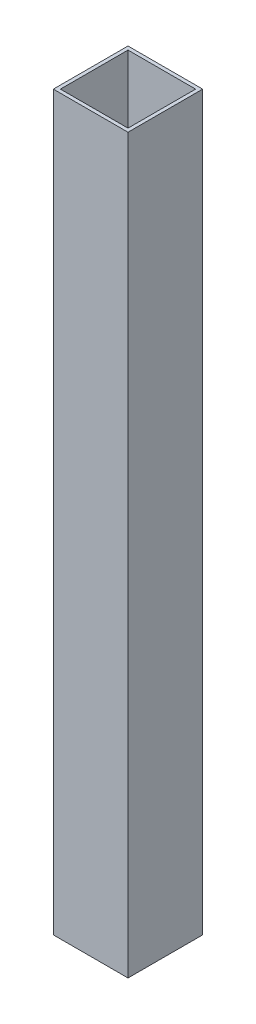
ISO-10303-21;
HEADER;
FILE_DESCRIPTION(('STEP AP214'),'2;1');
FILE_NAME('part.step','',(''),(''),'','','');
FILE_SCHEMA(('AUTOMOTIVE_DESIGN { 1 0 10303 214 1 1 1 1 }'));
ENDSEC;
DATA;
#1=APPLICATION_CONTEXT('core data for automotive mechanical design processes');
#2=APPLICATION_PROTOCOL_DEFINITION('international standard','automotive_design',2000,#1);
#3=PRODUCT_CONTEXT('',#1,'mechanical');
#4=PRODUCT('Part','Part','',(#3));
#5=PRODUCT_RELATED_PRODUCT_CATEGORY('part','',(#4));
#6=PRODUCT_DEFINITION_FORMATION('','',#4);
#7=PRODUCT_DEFINITION_CONTEXT('part definition',#1,'design');
#8=PRODUCT_DEFINITION('design','',#6,#7);
#9=PRODUCT_DEFINITION_SHAPE('','',#8);
#10=(LENGTH_UNIT() NAMED_UNIT(*) SI_UNIT(.MILLI.,.METRE.));
#11=(NAMED_UNIT(*) PLANE_ANGLE_UNIT() SI_UNIT($,.RADIAN.));
#12=(NAMED_UNIT(*) SI_UNIT($,.STERADIAN.) SOLID_ANGLE_UNIT());
#13=UNCERTAINTY_MEASURE_WITH_UNIT(LENGTH_MEASURE(1.E-05),#10,'distance_accuracy_value','');
#14=(GEOMETRIC_REPRESENTATION_CONTEXT(3) GLOBAL_UNCERTAINTY_ASSIGNED_CONTEXT((#13)) GLOBAL_UNIT_ASSIGNED_CONTEXT((#10,
#11,#12)) REPRESENTATION_CONTEXT('',''));
#15=CARTESIAN_POINT('',(0.,0.,0.));
#16=DIRECTION('',(0.,0.,1.));
#17=DIRECTION('',(1.,0.,0.));
#18=AXIS2_PLACEMENT_3D('',#15,#16,#17);
#19=CARTESIAN_POINT('',(0.,249.2,0.));
#20=DIRECTION('',(0.,1.,0.));
#21=DIRECTION('',(0.,0.,1.));
#22=AXIS2_PLACEMENT_3D('',#19,#20,#21);
#23=PLANE('',#22);
#24=DIRECTION('',(0.,0.,1.));
#25=VECTOR('',#24,1.);
#26=CARTESIAN_POINT('',(0.,249.2,-25.4));
#27=LINE('',#26,#25);
#28=CARTESIAN_POINT('',(0.,249.2,-25.4));
#29=VERTEX_POINT('',#28);
#30=CARTESIAN_POINT('',(0.,249.2,0.));
#31=VERTEX_POINT('',#30);
#32=EDGE_CURVE('E156',#29,#31,#27,.T.);
#33=ORIENTED_EDGE('',*,*,#32,.T.);
#34=DIRECTION('',(1.,0.,0.));
#35=VECTOR('',#34,1.);
#36=CARTESIAN_POINT('',(0.,249.2,0.));
#37=LINE('',#36,#35);
#38=CARTESIAN_POINT('',(25.4,249.2,0.));
#39=VERTEX_POINT('',#38);
#40=EDGE_CURVE('E160',#31,#39,#37,.T.);
#41=ORIENTED_EDGE('',*,*,#40,.T.);
#42=DIRECTION('',(0.,0.,-1.));
#43=VECTOR('',#42,1.);
#44=CARTESIAN_POINT('',(25.4,249.2,0.));
#45=LINE('',#44,#43);
#46=CARTESIAN_POINT('',(25.4,249.2,-25.4));
#47=VERTEX_POINT('',#46);
#48=EDGE_CURVE('E164',#39,#47,#45,.T.);
#49=ORIENTED_EDGE('',*,*,#48,.T.);
#50=DIRECTION('',(-1.,0.,0.));
#51=VECTOR('',#50,1.);
#52=CARTESIAN_POINT('',(25.4,249.2,-25.4));
#53=LINE('',#52,#51);
#54=EDGE_CURVE('E167',#47,#29,#53,.T.);
#55=ORIENTED_EDGE('',*,*,#54,.T.);
#56=EDGE_LOOP('',(#33,#41,#49,#55));
#57=FACE_BOUND('',#56,.T.);
#58=DIRECTION('',(0.,0.,1.));
#59=VECTOR('',#58,1.);
#60=CARTESIAN_POINT('',(1.2,249.2,-24.2));
#61=LINE('',#60,#59);
#62=CARTESIAN_POINT('',(1.2,249.2,-24.2));
#63=VERTEX_POINT('',#62);
#64=CARTESIAN_POINT('',(1.2,249.2,-1.2));
#65=VERTEX_POINT('',#64);
#66=EDGE_CURVE('E117',#63,#65,#61,.T.);
#67=ORIENTED_EDGE('',*,*,#66,.F.);
#68=DIRECTION('',(-1.,0.,0.));
#69=VECTOR('',#68,1.);
#70=CARTESIAN_POINT('',(24.2,249.2,-24.2));
#71=LINE('',#70,#69);
#72=CARTESIAN_POINT('',(24.2,249.2,-24.2));
#73=VERTEX_POINT('',#72);
#74=EDGE_CURVE('E108',#73,#63,#71,.T.);
#75=ORIENTED_EDGE('',*,*,#74,.F.);
#76=DIRECTION('',(0.,0.,-1.));
#77=VECTOR('',#76,1.);
#78=CARTESIAN_POINT('',(24.2,249.2,-1.2));
#79=LINE('',#78,#77);
#80=CARTESIAN_POINT('',(24.2,249.2,-1.2));
#81=VERTEX_POINT('',#80);
#82=EDGE_CURVE('E134',#81,#73,#79,.T.);
#83=ORIENTED_EDGE('',*,*,#82,.F.);
#84=DIRECTION('',(1.,0.,0.));
#85=VECTOR('',#84,1.);
#86=CARTESIAN_POINT('',(1.2,249.2,-1.2));
#87=LINE('',#86,#85);
#88=EDGE_CURVE('E130',#65,#81,#87,.T.);
#89=ORIENTED_EDGE('',*,*,#88,.F.);
#90=EDGE_LOOP('',(#67,#75,#83,#89));
#91=FACE_BOUND('',#90,.T.);
#92=ADVANCED_FACE('F42',(#57,#91),#23,.T.);
#93=CARTESIAN_POINT('',(0.,0.,0.));
#94=DIRECTION('',(0.,1.,0.));
#95=DIRECTION('',(0.,0.,1.));
#96=AXIS2_PLACEMENT_3D('',#93,#94,#95);
#97=PLANE('',#96);
#98=DIRECTION('',(0.,0.,1.));
#99=VECTOR('',#98,1.);
#100=CARTESIAN_POINT('',(0.,0.,-25.4));
#101=LINE('',#100,#99);
#102=CARTESIAN_POINT('',(0.,0.,-25.4));
#103=VERTEX_POINT('',#102);
#104=CARTESIAN_POINT('',(0.,0.,0.));
#105=VERTEX_POINT('',#104);
#106=EDGE_CURVE('E126',#103,#105,#101,.T.);
#107=ORIENTED_EDGE('',*,*,#106,.F.);
#108=DIRECTION('',(-1.,0.,0.));
#109=VECTOR('',#108,1.);
#110=CARTESIAN_POINT('',(25.4,0.,-25.4));
#111=LINE('',#110,#109);
#112=CARTESIAN_POINT('',(25.4,0.,-25.4));
#113=VERTEX_POINT('',#112);
#114=EDGE_CURVE('E161',#113,#103,#111,.T.);
#115=ORIENTED_EDGE('',*,*,#114,.F.);
#116=DIRECTION('',(0.,0.,-1.));
#117=VECTOR('',#116,1.);
#118=CARTESIAN_POINT('',(25.4,0.,0.));
#119=LINE('',#118,#117);
#120=CARTESIAN_POINT('',(25.4,0.,0.));
#121=VERTEX_POINT('',#120);
#122=EDGE_CURVE('E177',#121,#113,#119,.T.);
#123=ORIENTED_EDGE('',*,*,#122,.F.);
#124=DIRECTION('',(1.,0.,0.));
#125=VECTOR('',#124,1.);
#126=CARTESIAN_POINT('',(0.,0.,0.));
#127=LINE('',#126,#125);
#128=EDGE_CURVE('E174',#105,#121,#127,.T.);
#129=ORIENTED_EDGE('',*,*,#128,.F.);
#130=EDGE_LOOP('',(#107,#115,#123,#129));
#131=FACE_BOUND('',#130,.T.);
#132=DIRECTION('',(-1.,0.,0.));
#133=VECTOR('',#132,1.);
#134=CARTESIAN_POINT('',(24.2,0.,-24.2));
#135=LINE('',#134,#133);
#136=CARTESIAN_POINT('',(24.2,0.,-24.2));
#137=VERTEX_POINT('',#136);
#138=CARTESIAN_POINT('',(1.2,0.,-24.2));
#139=VERTEX_POINT('',#138);
#140=EDGE_CURVE('E66',#137,#139,#135,.T.);
#141=ORIENTED_EDGE('',*,*,#140,.T.);
#142=DIRECTION('',(0.,0.,1.));
#143=VECTOR('',#142,1.);
#144=CARTESIAN_POINT('',(1.2,0.,-24.2));
#145=LINE('',#144,#143);
#146=CARTESIAN_POINT('',(1.2,0.,-1.2));
#147=VERTEX_POINT('',#146);
#148=EDGE_CURVE('E124',#139,#147,#145,.T.);
#149=ORIENTED_EDGE('',*,*,#148,.T.);
#150=DIRECTION('',(1.,0.,0.));
#151=VECTOR('',#150,1.);
#152=CARTESIAN_POINT('',(1.2,0.,-1.2));
#153=LINE('',#152,#151);
#154=CARTESIAN_POINT('',(24.2,0.,-1.2));
#155=VERTEX_POINT('',#154);
#156=EDGE_CURVE('E143',#147,#155,#153,.T.);
#157=ORIENTED_EDGE('',*,*,#156,.T.);
#158=DIRECTION('',(0.,0.,-1.));
#159=VECTOR('',#158,1.);
#160=CARTESIAN_POINT('',(24.2,0.,-1.2));
#161=LINE('',#160,#159);
#162=EDGE_CURVE('E118',#155,#137,#161,.T.);
#163=ORIENTED_EDGE('',*,*,#162,.T.);
#164=EDGE_LOOP('',(#141,#149,#157,#163));
#165=FACE_BOUND('',#164,.T.);
#166=ADVANCED_FACE('F200',(#131,#165),#97,.F.);
#167=CARTESIAN_POINT('',(0.,249.2,-25.4));
#168=DIRECTION('',(1.,0.,0.));
#169=DIRECTION('',(0.,0.,-1.));
#170=AXIS2_PLACEMENT_3D('',#167,#168,#169);
#171=PLANE('',#170);
#172=ORIENTED_EDGE('',*,*,#106,.T.);
#173=DIRECTION('',(0.,-1.,0.));
#174=VECTOR('',#173,1.);
#175=CARTESIAN_POINT('',(0.,249.2,0.));
#176=LINE('',#175,#174);
#177=EDGE_CURVE('E11',#31,#105,#176,.T.);
#178=ORIENTED_EDGE('',*,*,#177,.F.);
#179=ORIENTED_EDGE('',*,*,#32,.F.);
#180=DIRECTION('',(0.,-1.,0.));
#181=VECTOR('',#180,1.);
#182=CARTESIAN_POINT('',(0.,249.2,-25.4));
#183=LINE('',#182,#181);
#184=EDGE_CURVE('E170',#29,#103,#183,.T.);
#185=ORIENTED_EDGE('',*,*,#184,.T.);
#186=EDGE_LOOP('',(#172,#178,#179,#185));
#187=FACE_BOUND('',#186,.T.);
#188=ADVANCED_FACE('F44',(#187),#171,.F.);
#189=CARTESIAN_POINT('',(0.,249.2,0.));
#190=DIRECTION('',(0.,0.,-1.));
#191=DIRECTION('',(-1.,0.,0.));
#192=AXIS2_PLACEMENT_3D('',#189,#190,#191);
#193=PLANE('',#192);
#194=ORIENTED_EDGE('',*,*,#128,.T.);
#195=DIRECTION('',(0.,-1.,0.));
#196=VECTOR('',#195,1.);
#197=CARTESIAN_POINT('',(25.4,249.2,0.));
#198=LINE('',#197,#196);
#199=EDGE_CURVE('E51',#39,#121,#198,.T.);
#200=ORIENTED_EDGE('',*,*,#199,.F.);
#201=ORIENTED_EDGE('',*,*,#40,.F.);
#202=ORIENTED_EDGE('',*,*,#177,.T.);
#203=EDGE_LOOP('',(#194,#200,#201,#202));
#204=FACE_BOUND('',#203,.T.);
#205=ADVANCED_FACE('F210',(#204),#193,.F.);
#206=CARTESIAN_POINT('',(25.4,249.2,0.));
#207=DIRECTION('',(-1.,0.,0.));
#208=DIRECTION('',(0.,0.,1.));
#209=AXIS2_PLACEMENT_3D('',#206,#207,#208);
#210=PLANE('',#209);
#211=ORIENTED_EDGE('',*,*,#122,.T.);
#212=DIRECTION('',(0.,-1.,0.));
#213=VECTOR('',#212,1.);
#214=CARTESIAN_POINT('',(25.4,249.2,-25.4));
#215=LINE('',#214,#213);
#216=EDGE_CURVE('E185',#47,#113,#215,.T.);
#217=ORIENTED_EDGE('',*,*,#216,.F.);
#218=ORIENTED_EDGE('',*,*,#48,.F.);
#219=ORIENTED_EDGE('',*,*,#199,.T.);
#220=EDGE_LOOP('',(#211,#217,#218,#219));
#221=FACE_BOUND('',#220,.T.);
#222=ADVANCED_FACE('F194',(#221),#210,.F.);
#223=CARTESIAN_POINT('',(25.4,249.2,-25.4));
#224=DIRECTION('',(0.,0.,1.));
#225=DIRECTION('',(1.,0.,0.));
#226=AXIS2_PLACEMENT_3D('',#223,#224,#225);
#227=PLANE('',#226);
#228=ORIENTED_EDGE('',*,*,#114,.T.);
#229=ORIENTED_EDGE('',*,*,#184,.F.);
#230=ORIENTED_EDGE('',*,*,#54,.F.);
#231=ORIENTED_EDGE('',*,*,#216,.T.);
#232=EDGE_LOOP('',(#228,#229,#230,#231));
#233=FACE_BOUND('',#232,.T.);
#234=ADVANCED_FACE('F204',(#233),#227,.F.);
#235=CARTESIAN_POINT('',(24.2,249.2,-24.2));
#236=DIRECTION('',(0.,0.,1.));
#237=DIRECTION('',(1.,0.,0.));
#238=AXIS2_PLACEMENT_3D('',#235,#236,#237);
#239=PLANE('',#238);
#240=ORIENTED_EDGE('',*,*,#140,.F.);
#241=DIRECTION('',(0.,-1.,0.));
#242=VECTOR('',#241,1.);
#243=CARTESIAN_POINT('',(24.2,249.2,-24.2));
#244=LINE('',#243,#242);
#245=EDGE_CURVE('E112',#73,#137,#244,.T.);
#246=ORIENTED_EDGE('',*,*,#245,.F.);
#247=ORIENTED_EDGE('',*,*,#74,.T.);
#248=DIRECTION('',(0.,-1.,0.));
#249=VECTOR('',#248,1.);
#250=CARTESIAN_POINT('',(1.2,249.2,-24.2));
#251=LINE('',#250,#249);
#252=EDGE_CURVE('E111',#63,#139,#251,.T.);
#253=ORIENTED_EDGE('',*,*,#252,.T.);
#254=EDGE_LOOP('',(#240,#246,#247,#253));
#255=FACE_BOUND('',#254,.T.);
#256=ADVANCED_FACE('F110',(#255),#239,.T.);
#257=CARTESIAN_POINT('',(1.2,249.2,-24.2));
#258=DIRECTION('',(1.,0.,0.));
#259=DIRECTION('',(0.,0.,-1.));
#260=AXIS2_PLACEMENT_3D('',#257,#258,#259);
#261=PLANE('',#260);
#262=ORIENTED_EDGE('',*,*,#148,.F.);
#263=ORIENTED_EDGE('',*,*,#252,.F.);
#264=ORIENTED_EDGE('',*,*,#66,.T.);
#265=DIRECTION('',(0.,-1.,0.));
#266=VECTOR('',#265,1.);
#267=CARTESIAN_POINT('',(1.2,249.2,-1.2));
#268=LINE('',#267,#266);
#269=EDGE_CURVE('E127',#65,#147,#268,.T.);
#270=ORIENTED_EDGE('',*,*,#269,.T.);
#271=EDGE_LOOP('',(#262,#263,#264,#270));
#272=FACE_BOUND('',#271,.T.);
#273=ADVANCED_FACE('F121',(#272),#261,.T.);
#274=CARTESIAN_POINT('',(1.2,249.2,-1.2));
#275=DIRECTION('',(0.,0.,-1.));
#276=DIRECTION('',(-1.,0.,0.));
#277=AXIS2_PLACEMENT_3D('',#274,#275,#276);
#278=PLANE('',#277);
#279=ORIENTED_EDGE('',*,*,#156,.F.);
#280=ORIENTED_EDGE('',*,*,#269,.F.);
#281=ORIENTED_EDGE('',*,*,#88,.T.);
#282=DIRECTION('',(0.,-1.,0.));
#283=VECTOR('',#282,1.);
#284=CARTESIAN_POINT('',(24.2,249.2,-1.2));
#285=LINE('',#284,#283);
#286=EDGE_CURVE('E58',#81,#155,#285,.T.);
#287=ORIENTED_EDGE('',*,*,#286,.T.);
#288=EDGE_LOOP('',(#279,#280,#281,#287));
#289=FACE_BOUND('',#288,.T.);
#290=ADVANCED_FACE('F233',(#289),#278,.T.);
#291=CARTESIAN_POINT('',(24.2,249.2,-1.2));
#292=DIRECTION('',(-1.,0.,0.));
#293=DIRECTION('',(0.,0.,1.));
#294=AXIS2_PLACEMENT_3D('',#291,#292,#293);
#295=PLANE('',#294);
#296=ORIENTED_EDGE('',*,*,#162,.F.);
#297=ORIENTED_EDGE('',*,*,#286,.F.);
#298=ORIENTED_EDGE('',*,*,#82,.T.);
#299=ORIENTED_EDGE('',*,*,#245,.T.);
#300=EDGE_LOOP('',(#296,#297,#298,#299));
#301=FACE_BOUND('',#300,.T.);
#302=ADVANCED_FACE('F237',(#301),#295,.T.);
#303=CLOSED_SHELL('',(#92,#166,#188,#205,#222,#234,#256,#273,#290,#302));
#304=MANIFOLD_SOLID_BREP('B2',#303);
#305=ADVANCED_BREP_SHAPE_REPRESENTATION('',(#18,#304),#14);
#306=SHAPE_DEFINITION_REPRESENTATION(#9,#305);
ENDSEC;
END-ISO-10303-21;
